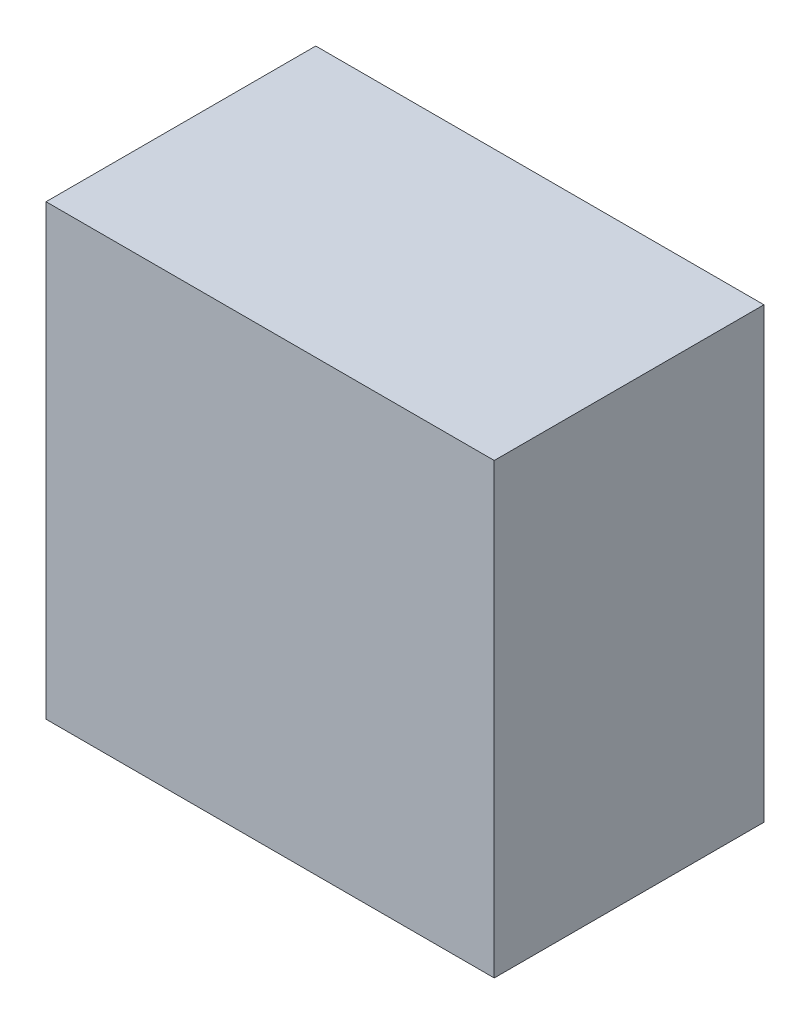
ISO-10303-21;
HEADER;
FILE_DESCRIPTION(('STEP AP214'),'2;1');
FILE_NAME('part.step','',(''),(''),'','','');
FILE_SCHEMA(('AUTOMOTIVE_DESIGN { 1 0 10303 214 1 1 1 1 }'));
ENDSEC;
DATA;
#1=APPLICATION_CONTEXT('core data for automotive mechanical design processes');
#2=APPLICATION_PROTOCOL_DEFINITION('international standard','automotive_design',2000,#1);
#3=PRODUCT_CONTEXT('',#1,'mechanical');
#4=PRODUCT('Part','Part','',(#3));
#5=PRODUCT_RELATED_PRODUCT_CATEGORY('part','',(#4));
#6=PRODUCT_DEFINITION_FORMATION('','',#4);
#7=PRODUCT_DEFINITION_CONTEXT('part definition',#1,'design');
#8=PRODUCT_DEFINITION('design','',#6,#7);
#9=PRODUCT_DEFINITION_SHAPE('','',#8);
#10=(LENGTH_UNIT() NAMED_UNIT(*) SI_UNIT(.MILLI.,.METRE.));
#11=(NAMED_UNIT(*) PLANE_ANGLE_UNIT() SI_UNIT($,.RADIAN.));
#12=(NAMED_UNIT(*) SI_UNIT($,.STERADIAN.) SOLID_ANGLE_UNIT());
#13=UNCERTAINTY_MEASURE_WITH_UNIT(LENGTH_MEASURE(1.E-05),#10,'distance_accuracy_value','');
#14=(GEOMETRIC_REPRESENTATION_CONTEXT(3) GLOBAL_UNCERTAINTY_ASSIGNED_CONTEXT((#13)) GLOBAL_UNIT_ASSIGNED_CONTEXT((#10,
#11,#12)) REPRESENTATION_CONTEXT('',''));
#15=CARTESIAN_POINT('',(0.,0.,0.));
#16=DIRECTION('',(0.,0.,1.));
#17=DIRECTION('',(1.,0.,0.));
#18=AXIS2_PLACEMENT_3D('',#15,#16,#17);
#19=CARTESIAN_POINT('',(-2.99949108,-2.99949108,3.61));
#20=DIRECTION('',(0.,0.,1.));
#21=DIRECTION('',(1.,0.,0.));
#22=AXIS2_PLACEMENT_3D('',#19,#20,#21);
#23=PLANE('',#22);
#24=DIRECTION('',(1.,0.,0.));
#25=VECTOR('',#24,1.);
#26=CARTESIAN_POINT('',(-2.99949108,2.99949108,3.61));
#27=LINE('',#26,#25);
#28=CARTESIAN_POINT('',(-2.99949108,2.99949108,3.61));
#29=VERTEX_POINT('',#28);
#30=CARTESIAN_POINT('',(2.99949108,2.99949108,3.61));
#31=VERTEX_POINT('',#30);
#32=EDGE_CURVE('E52',#29,#31,#27,.T.);
#33=ORIENTED_EDGE('',*,*,#32,.F.);
#34=DIRECTION('',(0.,1.,0.));
#35=VECTOR('',#34,1.);
#36=CARTESIAN_POINT('',(-2.99949108,-2.99949108,3.61));
#37=LINE('',#36,#35);
#38=CARTESIAN_POINT('',(-2.99949108,-2.99949108,3.61));
#39=VERTEX_POINT('',#38);
#40=EDGE_CURVE('E67',#39,#29,#37,.T.);
#41=ORIENTED_EDGE('',*,*,#40,.F.);
#42=DIRECTION('',(1.,0.,0.));
#43=VECTOR('',#42,1.);
#44=CARTESIAN_POINT('',(2.99949108,-2.99949108,3.61));
#45=LINE('',#44,#43);
#46=CARTESIAN_POINT('',(2.99949108,-2.99949108,3.61));
#47=VERTEX_POINT('',#46);
#48=EDGE_CURVE('E19',#47,#39,#45,.F.);
#49=ORIENTED_EDGE('',*,*,#48,.F.);
#50=DIRECTION('',(0.,1.,0.));
#51=VECTOR('',#50,1.);
#52=CARTESIAN_POINT('',(2.99949108,2.99949108,3.61));
#53=LINE('',#52,#51);
#54=EDGE_CURVE('E57',#31,#47,#53,.F.);
#55=ORIENTED_EDGE('',*,*,#54,.F.);
#56=EDGE_LOOP('',(#33,#41,#49,#55));
#57=FACE_BOUND('',#56,.T.);
#58=ADVANCED_FACE('F16',(#57),#23,.T.);
#59=CARTESIAN_POINT('',(2.99949108,-2.99949108,0.));
#60=DIRECTION('',(0.,-1.,0.));
#61=DIRECTION('',(0.,0.,-1.));
#62=AXIS2_PLACEMENT_3D('',#59,#60,#61);
#63=PLANE('',#62);
#64=DIRECTION('',(0.,0.,1.));
#65=VECTOR('',#64,1.);
#66=CARTESIAN_POINT('',(-2.99949108,-2.99949108,0.));
#67=LINE('',#66,#65);
#68=CARTESIAN_POINT('',(-2.99949108,-2.99949108,0.));
#69=VERTEX_POINT('',#68);
#70=EDGE_CURVE('E78',#69,#39,#67,.T.);
#71=ORIENTED_EDGE('',*,*,#70,.F.);
#72=DIRECTION('',(1.,0.,0.));
#73=VECTOR('',#72,1.);
#74=CARTESIAN_POINT('',(-2.99949108,-2.99949108,0.));
#75=LINE('',#74,#73);
#76=CARTESIAN_POINT('',(2.99949108,-2.99949108,0.));
#77=VERTEX_POINT('',#76);
#78=EDGE_CURVE('E73',#69,#77,#75,.T.);
#79=ORIENTED_EDGE('',*,*,#78,.T.);
#80=DIRECTION('',(0.,0.,-1.));
#81=VECTOR('',#80,1.);
#82=CARTESIAN_POINT('',(2.99949108,-2.99949108,0.));
#83=LINE('',#82,#81);
#84=EDGE_CURVE('E62',#47,#77,#83,.T.);
#85=ORIENTED_EDGE('',*,*,#84,.F.);
#86=ORIENTED_EDGE('',*,*,#48,.T.);
#87=EDGE_LOOP('',(#71,#79,#85,#86));
#88=FACE_BOUND('',#87,.T.);
#89=ADVANCED_FACE('F72',(#88),#63,.T.);
#90=CARTESIAN_POINT('',(2.99949108,2.99949108,0.));
#91=DIRECTION('',(1.,0.,0.));
#92=DIRECTION('',(0.,0.,-1.));
#93=AXIS2_PLACEMENT_3D('',#90,#91,#92);
#94=PLANE('',#93);
#95=ORIENTED_EDGE('',*,*,#84,.T.);
#96=DIRECTION('',(0.,1.,0.));
#97=VECTOR('',#96,1.);
#98=CARTESIAN_POINT('',(2.99949108,-2.99949108,0.));
#99=LINE('',#98,#97);
#100=CARTESIAN_POINT('',(2.99949108,2.99949108,0.));
#101=VERTEX_POINT('',#100);
#102=EDGE_CURVE('E83',#77,#101,#99,.T.);
#103=ORIENTED_EDGE('',*,*,#102,.T.);
#104=DIRECTION('',(0.,0.,1.));
#105=VECTOR('',#104,1.);
#106=CARTESIAN_POINT('',(2.99949108,2.99949108,0.));
#107=LINE('',#106,#105);
#108=EDGE_CURVE('E64',#31,#101,#107,.F.);
#109=ORIENTED_EDGE('',*,*,#108,.F.);
#110=ORIENTED_EDGE('',*,*,#54,.T.);
#111=EDGE_LOOP('',(#95,#103,#109,#110));
#112=FACE_BOUND('',#111,.T.);
#113=ADVANCED_FACE('F59',(#112),#94,.T.);
#114=CARTESIAN_POINT('',(-2.99949108,2.99949108,0.));
#115=DIRECTION('',(0.,1.,0.));
#116=DIRECTION('',(0.,0.,1.));
#117=AXIS2_PLACEMENT_3D('',#114,#115,#116);
#118=PLANE('',#117);
#119=ORIENTED_EDGE('',*,*,#108,.T.);
#120=DIRECTION('',(1.,0.,0.));
#121=VECTOR('',#120,1.);
#122=CARTESIAN_POINT('',(-2.99949108,2.99949108,0.));
#123=LINE('',#122,#121);
#124=CARTESIAN_POINT('',(-2.99949108,2.99949108,0.));
#125=VERTEX_POINT('',#124);
#126=EDGE_CURVE('E25',#101,#125,#123,.F.);
#127=ORIENTED_EDGE('',*,*,#126,.T.);
#128=DIRECTION('',(0.,0.,1.));
#129=VECTOR('',#128,1.);
#130=CARTESIAN_POINT('',(-2.99949108,2.99949108,0.));
#131=LINE('',#130,#129);
#132=EDGE_CURVE('E33',#29,#125,#131,.F.);
#133=ORIENTED_EDGE('',*,*,#132,.F.);
#134=ORIENTED_EDGE('',*,*,#32,.T.);
#135=EDGE_LOOP('',(#119,#127,#133,#134));
#136=FACE_BOUND('',#135,.T.);
#137=ADVANCED_FACE('F87',(#136),#118,.T.);
#138=CARTESIAN_POINT('',(-2.99949108,-2.99949108,0.));
#139=DIRECTION('',(-1.,0.,0.));
#140=DIRECTION('',(0.,0.,1.));
#141=AXIS2_PLACEMENT_3D('',#138,#139,#140);
#142=PLANE('',#141);
#143=ORIENTED_EDGE('',*,*,#132,.T.);
#144=DIRECTION('',(0.,1.,0.));
#145=VECTOR('',#144,1.);
#146=CARTESIAN_POINT('',(-2.99949108,-2.99949108,0.));
#147=LINE('',#146,#145);
#148=EDGE_CURVE('E11',#125,#69,#147,.F.);
#149=ORIENTED_EDGE('',*,*,#148,.T.);
#150=ORIENTED_EDGE('',*,*,#70,.T.);
#151=ORIENTED_EDGE('',*,*,#40,.T.);
#152=EDGE_LOOP('',(#143,#149,#150,#151));
#153=FACE_BOUND('',#152,.T.);
#154=ADVANCED_FACE('F90',(#153),#142,.T.);
#155=CARTESIAN_POINT('',(-2.99949108,-2.99949108,0.));
#156=DIRECTION('',(0.,0.,1.));
#157=DIRECTION('',(1.,0.,0.));
#158=AXIS2_PLACEMENT_3D('',#155,#156,#157);
#159=PLANE('',#158);
#160=ORIENTED_EDGE('',*,*,#126,.F.);
#161=ORIENTED_EDGE('',*,*,#102,.F.);
#162=ORIENTED_EDGE('',*,*,#78,.F.);
#163=ORIENTED_EDGE('',*,*,#148,.F.);
#164=EDGE_LOOP('',(#160,#161,#162,#163));
#165=FACE_BOUND('',#164,.T.);
#166=ADVANCED_FACE('F89',(#165),#159,.F.);
#167=CLOSED_SHELL('',(#58,#89,#113,#137,#154,#166));
#168=MANIFOLD_SOLID_BREP('B1',#167);
#169=ADVANCED_BREP_SHAPE_REPRESENTATION('',(#18,#168),#14);
#170=SHAPE_DEFINITION_REPRESENTATION(#9,#169);
ENDSEC;
END-ISO-10303-21;
